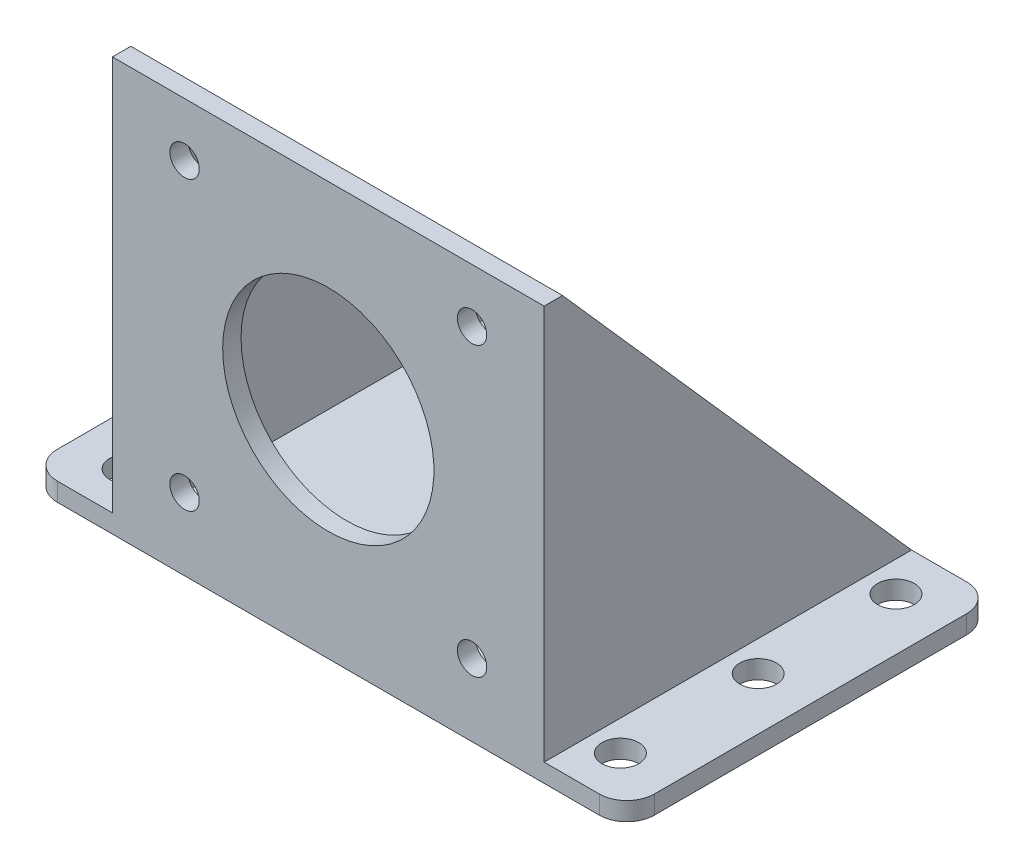
ISO-10303-21;
HEADER;
FILE_DESCRIPTION(('STEP AP214'),'2;1');
FILE_NAME('part.step','',(''),(''),'','','');
FILE_SCHEMA(('AUTOMOTIVE_DESIGN { 1 0 10303 214 1 1 1 1 }'));
ENDSEC;
DATA;
#1=APPLICATION_CONTEXT('core data for automotive mechanical design processes');
#2=APPLICATION_PROTOCOL_DEFINITION('international standard','automotive_design',2000,#1);
#3=PRODUCT_CONTEXT('',#1,'mechanical');
#4=PRODUCT('Part','Part','',(#3));
#5=PRODUCT_RELATED_PRODUCT_CATEGORY('part','',(#4));
#6=PRODUCT_DEFINITION_FORMATION('','',#4);
#7=PRODUCT_DEFINITION_CONTEXT('part definition',#1,'design');
#8=PRODUCT_DEFINITION('design','',#6,#7);
#9=PRODUCT_DEFINITION_SHAPE('','',#8);
#10=(LENGTH_UNIT() NAMED_UNIT(*) SI_UNIT(.MILLI.,.METRE.));
#11=(NAMED_UNIT(*) PLANE_ANGLE_UNIT() SI_UNIT($,.RADIAN.));
#12=(NAMED_UNIT(*) SI_UNIT($,.STERADIAN.) SOLID_ANGLE_UNIT());
#13=UNCERTAINTY_MEASURE_WITH_UNIT(LENGTH_MEASURE(1.E-05),#10,'distance_accuracy_value','');
#14=(GEOMETRIC_REPRESENTATION_CONTEXT(3) GLOBAL_UNCERTAINTY_ASSIGNED_CONTEXT((#13)) GLOBAL_UNIT_ASSIGNED_CONTEXT((#10,
#11,#12)) REPRESENTATION_CONTEXT('',''));
#15=CARTESIAN_POINT('',(0.,0.,0.));
#16=DIRECTION('',(0.,0.,1.));
#17=DIRECTION('',(1.,0.,0.));
#18=AXIS2_PLACEMENT_3D('',#15,#16,#17);
#19=CARTESIAN_POINT('',(0.,2.,0.));
#20=DIRECTION('',(0.,-1.,0.));
#21=DIRECTION('',(0.,0.,-1.));
#22=AXIS2_PLACEMENT_3D('',#19,#20,#21);
#23=PLANE('',#22);
#24=DIRECTION('',(0.,0.,1.));
#25=VECTOR('',#24,1.);
#26=CARTESIAN_POINT('',(54.,2.,0.));
#27=LINE('',#26,#25);
#28=CARTESIAN_POINT('',(54.,2.00000000000001,-40.));
#29=VERTEX_POINT('',#28);
#30=CARTESIAN_POINT('',(54.,2.,-2.));
#31=VERTEX_POINT('',#30);
#32=EDGE_CURVE('E193',#29,#31,#27,.T.);
#33=ORIENTED_EDGE('',*,*,#32,.F.);
#34=DIRECTION('',(-1.,0.,0.));
#35=VECTOR('',#34,1.);
#36=CARTESIAN_POINT('',(0.,2.,-40.));
#37=LINE('',#36,#35);
#38=CARTESIAN_POINT('',(11.,2.,-40.));
#39=VERTEX_POINT('',#38);
#40=EDGE_CURVE('E162',#29,#39,#37,.T.);
#41=ORIENTED_EDGE('',*,*,#40,.T.);
#42=DIRECTION('',(0.,0.,-1.));
#43=VECTOR('',#42,1.);
#44=CARTESIAN_POINT('',(11.,2.,0.));
#45=LINE('',#44,#43);
#46=CARTESIAN_POINT('',(11.,2.,-2.));
#47=VERTEX_POINT('',#46);
#48=EDGE_CURVE('E204',#47,#39,#45,.T.);
#49=ORIENTED_EDGE('',*,*,#48,.F.);
#50=DIRECTION('',(1.,0.,0.));
#51=VECTOR('',#50,1.);
#52=CARTESIAN_POINT('',(9.,2.,-2.));
#53=LINE('',#52,#51);
#54=EDGE_CURVE('E214',#47,#31,#53,.T.);
#55=ORIENTED_EDGE('',*,*,#54,.T.);
#56=EDGE_LOOP('',(#33,#41,#49,#55));
#57=FACE_BOUND('',#56,.T.);
#58=ADVANCED_FACE('F39',(#57),#23,.F.);
#59=CARTESIAN_POINT('',(0.,0.,-2.));
#60=DIRECTION('',(0.,0.,-1.));
#61=DIRECTION('',(-1.,0.,0.));
#62=AXIS2_PLACEMENT_3D('',#59,#60,#61);
#63=PLANE('',#62);
#64=CARTESIAN_POINT('',(48.1500000000001,39.15,-2.));
#65=DIRECTION('',(0.,0.,-1.));
#66=DIRECTION('',(-1.,0.,0.));
#67=AXIS2_PLACEMENT_3D('',#64,#65,#66);
#68=CIRCLE('',#67,1.6);
#69=CARTESIAN_POINT('',(46.5500000000001,39.15,-2.));
#70=VERTEX_POINT('',#69);
#71=EDGE_CURVE('E431',#70,#70,#68,.T.);
#72=ORIENTED_EDGE('',*,*,#71,.F.);
#73=EDGE_LOOP('',(#72));
#74=FACE_BOUND('',#73,.T.);
#75=CARTESIAN_POINT('',(16.8500000000001,39.15,-2.));
#76=DIRECTION('',(0.,0.,-1.));
#77=DIRECTION('',(-1.,0.,0.));
#78=AXIS2_PLACEMENT_3D('',#75,#76,#77);
#79=CIRCLE('',#78,1.6);
#80=CARTESIAN_POINT('',(15.2500000000001,39.15,-2.));
#81=VERTEX_POINT('',#80);
#82=EDGE_CURVE('E439',#81,#81,#79,.T.);
#83=ORIENTED_EDGE('',*,*,#82,.F.);
#84=EDGE_LOOP('',(#83));
#85=FACE_BOUND('',#84,.T.);
#86=CARTESIAN_POINT('',(16.85,7.85,-2.));
#87=DIRECTION('',(0.,0.,-1.));
#88=DIRECTION('',(-1.,0.,0.));
#89=AXIS2_PLACEMENT_3D('',#86,#87,#88);
#90=CIRCLE('',#89,1.6);
#91=CARTESIAN_POINT('',(15.25,7.85,-2.));
#92=VERTEX_POINT('',#91);
#93=EDGE_CURVE('E447',#92,#92,#90,.T.);
#94=ORIENTED_EDGE('',*,*,#93,.F.);
#95=EDGE_LOOP('',(#94));
#96=FACE_BOUND('',#95,.T.);
#97=CARTESIAN_POINT('',(48.15,7.85,-2.));
#98=DIRECTION('',(0.,0.,-1.));
#99=DIRECTION('',(-1.,0.,0.));
#100=AXIS2_PLACEMENT_3D('',#97,#98,#99);
#101=CIRCLE('',#100,1.6);
#102=CARTESIAN_POINT('',(46.55,7.85,-2.));
#103=VERTEX_POINT('',#102);
#104=EDGE_CURVE('E455',#103,#103,#101,.T.);
#105=ORIENTED_EDGE('',*,*,#104,.F.);
#106=EDGE_LOOP('',(#105));
#107=FACE_BOUND('',#106,.T.);
#108=CARTESIAN_POINT('',(32.5,23.5,-2.));
#109=DIRECTION('',(0.,0.,-1.));
#110=DIRECTION('',(-1.,0.,0.));
#111=AXIS2_PLACEMENT_3D('',#108,#109,#110);
#112=CIRCLE('',#111,11.5);
#113=CARTESIAN_POINT('',(21.,23.5,-2.));
#114=VERTEX_POINT('',#113);
#115=EDGE_CURVE('E423',#114,#114,#112,.T.);
#116=ORIENTED_EDGE('',*,*,#115,.F.);
#117=EDGE_LOOP('',(#116));
#118=FACE_BOUND('',#117,.T.);
#119=DIRECTION('',(-1.,0.,0.));
#120=VECTOR('',#119,1.);
#121=CARTESIAN_POINT('',(9.,45.,-2.));
#122=LINE('',#121,#120);
#123=CARTESIAN_POINT('',(54.,45.,-2.));
#124=VERTEX_POINT('',#123);
#125=CARTESIAN_POINT('',(11.,45.,-2.));
#126=VERTEX_POINT('',#125);
#127=EDGE_CURVE('E222',#124,#126,#122,.T.);
#128=ORIENTED_EDGE('',*,*,#127,.F.);
#129=DIRECTION('',(0.,-1.,0.));
#130=VECTOR('',#129,1.);
#131=CARTESIAN_POINT('',(54.,0.,-2.));
#132=LINE('',#131,#130);
#133=EDGE_CURVE('E185',#124,#31,#132,.T.);
#134=ORIENTED_EDGE('',*,*,#133,.T.);
#135=ORIENTED_EDGE('',*,*,#54,.F.);
#136=DIRECTION('',(0.,1.,0.));
#137=VECTOR('',#136,1.);
#138=CARTESIAN_POINT('',(11.,0.,-2.));
#139=LINE('',#138,#137);
#140=EDGE_CURVE('E161',#47,#126,#139,.T.);
#141=ORIENTED_EDGE('',*,*,#140,.T.);
#142=EDGE_LOOP('',(#128,#134,#135,#141));
#143=FACE_BOUND('',#142,.T.);
#144=ADVANCED_FACE('F415',(#74,#85,#96,#107,#118,#143),#63,.T.);
#145=CARTESIAN_POINT('',(59.3,2.,-5.));
#146=DIRECTION('',(0.,1.,0.));
#147=DIRECTION('',(0.,0.,-1.));
#148=AXIS2_PLACEMENT_3D('',#145,#146,#147);
#149=CIRCLE('',#148,2.);
#150=CARTESIAN_POINT('',(59.3,2.,-7.));
#151=VERTEX_POINT('',#150);
#152=EDGE_CURVE('E269',#151,#151,#149,.T.);
#153=ORIENTED_EDGE('',*,*,#152,.F.);
#154=EDGE_LOOP('',(#153));
#155=FACE_BOUND('',#154,.T.);
#156=CARTESIAN_POINT('',(59.3,2.,-20.));
#157=DIRECTION('',(0.,1.,0.));
#158=DIRECTION('',(0.,0.,-1.));
#159=AXIS2_PLACEMENT_3D('',#156,#157,#158);
#160=CIRCLE('',#159,2.);
#161=CARTESIAN_POINT('',(59.3,2.,-22.));
#162=VERTEX_POINT('',#161);
#163=EDGE_CURVE('E244',#162,#162,#160,.T.);
#164=ORIENTED_EDGE('',*,*,#163,.F.);
#165=EDGE_LOOP('',(#164));
#166=FACE_BOUND('',#165,.T.);
#167=CARTESIAN_POINT('',(59.3,2.,-35.));
#168=DIRECTION('',(0.,1.,0.));
#169=DIRECTION('',(0.,0.,-1.));
#170=AXIS2_PLACEMENT_3D('',#167,#168,#169);
#171=CIRCLE('',#170,2.);
#172=CARTESIAN_POINT('',(59.3,2.,-37.));
#173=VERTEX_POINT('',#172);
#174=EDGE_CURVE('E234',#173,#173,#171,.T.);
#175=ORIENTED_EDGE('',*,*,#174,.F.);
#176=EDGE_LOOP('',(#175));
#177=FACE_BOUND('',#176,.T.);
#178=DIRECTION('',(0.,0.,-1.));
#179=VECTOR('',#178,1.);
#180=CARTESIAN_POINT('',(65.,2.,0.));
#181=LINE('',#180,#179);
#182=CARTESIAN_POINT('',(65.,2.,-3.));
#183=VERTEX_POINT('',#182);
#184=CARTESIAN_POINT('',(65.,2.,-37.));
#185=VERTEX_POINT('',#184);
#186=EDGE_CURVE('E296',#183,#185,#181,.T.);
#187=ORIENTED_EDGE('',*,*,#186,.T.);
#188=CARTESIAN_POINT('',(62.,2.,-37.));
#189=DIRECTION('',(0.,-1.,0.));
#190=DIRECTION('',(0.,0.,-1.));
#191=AXIS2_PLACEMENT_3D('',#188,#189,#190);
#192=CIRCLE('',#191,3.);
#193=CARTESIAN_POINT('',(62.,2.,-40.));
#194=VERTEX_POINT('',#193);
#195=EDGE_CURVE('E155',#185,#194,#192,.F.);
#196=ORIENTED_EDGE('',*,*,#195,.T.);
#197=CARTESIAN_POINT('',(56.,2.00000000000001,-40.));
#198=VERTEX_POINT('',#197);
#199=EDGE_CURVE('E147',#194,#198,#37,.T.);
#200=ORIENTED_EDGE('',*,*,#199,.T.);
#201=DIRECTION('',(0.,0.,1.));
#202=VECTOR('',#201,1.);
#203=CARTESIAN_POINT('',(56.,2.,-2.));
#204=LINE('',#203,#202);
#205=CARTESIAN_POINT('',(56.,2.,0.));
#206=VERTEX_POINT('',#205);
#207=EDGE_CURVE('E152',#198,#206,#204,.T.);
#208=ORIENTED_EDGE('',*,*,#207,.T.);
#209=DIRECTION('',(1.,0.,0.));
#210=VECTOR('',#209,1.);
#211=CARTESIAN_POINT('',(0.,2.,0.));
#212=LINE('',#211,#210);
#213=CARTESIAN_POINT('',(62.,2.,0.));
#214=VERTEX_POINT('',#213);
#215=EDGE_CURVE('E291',#206,#214,#212,.T.);
#216=ORIENTED_EDGE('',*,*,#215,.T.);
#217=CARTESIAN_POINT('',(62.,2.,-3.));
#218=DIRECTION('',(0.,-1.,0.));
#219=DIRECTION('',(0.,0.,-1.));
#220=AXIS2_PLACEMENT_3D('',#217,#218,#219);
#221=CIRCLE('',#220,3.);
#222=EDGE_CURVE('E340',#214,#183,#221,.F.);
#223=ORIENTED_EDGE('',*,*,#222,.T.);
#224=EDGE_LOOP('',(#187,#196,#200,#208,#216,#223));
#225=FACE_BOUND('',#224,.T.);
#226=ADVANCED_FACE('F150',(#155,#166,#177,#225),#23,.F.);
#227=CARTESIAN_POINT('',(5.7,2.,-5.));
#228=DIRECTION('',(0.,1.,0.));
#229=DIRECTION('',(0.,0.,1.));
#230=AXIS2_PLACEMENT_3D('',#227,#228,#229);
#231=CIRCLE('',#230,2.);
#232=CARTESIAN_POINT('',(5.7,2.,-3.));
#233=VERTEX_POINT('',#232);
#234=EDGE_CURVE('E252',#233,#233,#231,.T.);
#235=ORIENTED_EDGE('',*,*,#234,.F.);
#236=EDGE_LOOP('',(#235));
#237=FACE_BOUND('',#236,.T.);
#238=CARTESIAN_POINT('',(5.7,2.,-35.));
#239=DIRECTION('',(0.,1.,0.));
#240=DIRECTION('',(0.,0.,1.));
#241=AXIS2_PLACEMENT_3D('',#238,#239,#240);
#242=CIRCLE('',#241,2.);
#243=CARTESIAN_POINT('',(5.7,2.,-33.));
#244=VERTEX_POINT('',#243);
#245=EDGE_CURVE('E261',#244,#244,#242,.T.);
#246=ORIENTED_EDGE('',*,*,#245,.F.);
#247=EDGE_LOOP('',(#246));
#248=FACE_BOUND('',#247,.T.);
#249=CARTESIAN_POINT('',(5.7,2.,-20.));
#250=DIRECTION('',(0.,1.,0.));
#251=DIRECTION('',(0.,0.,1.));
#252=AXIS2_PLACEMENT_3D('',#249,#250,#251);
#253=CIRCLE('',#252,2.);
#254=CARTESIAN_POINT('',(5.7,2.,-18.));
#255=VERTEX_POINT('',#254);
#256=EDGE_CURVE('E253',#255,#255,#253,.T.);
#257=ORIENTED_EDGE('',*,*,#256,.F.);
#258=EDGE_LOOP('',(#257));
#259=FACE_BOUND('',#258,.T.);
#260=CARTESIAN_POINT('',(9.,2.,-40.));
#261=VERTEX_POINT('',#260);
#262=CARTESIAN_POINT('',(3.,2.,-40.));
#263=VERTEX_POINT('',#262);
#264=EDGE_CURVE('E164',#261,#263,#37,.T.);
#265=ORIENTED_EDGE('',*,*,#264,.T.);
#266=CARTESIAN_POINT('',(3.,2.,-37.));
#267=DIRECTION('',(0.,-1.,0.));
#268=DIRECTION('',(0.,0.,-1.));
#269=AXIS2_PLACEMENT_3D('',#266,#267,#268);
#270=CIRCLE('',#269,3.);
#271=CARTESIAN_POINT('',(0.,2.,-37.));
#272=VERTEX_POINT('',#271);
#273=EDGE_CURVE('E11',#263,#272,#270,.F.);
#274=ORIENTED_EDGE('',*,*,#273,.T.);
#275=DIRECTION('',(0.,0.,1.));
#276=VECTOR('',#275,1.);
#277=CARTESIAN_POINT('',(0.,2.,0.));
#278=LINE('',#277,#276);
#279=CARTESIAN_POINT('',(0.,2.,-3.));
#280=VERTEX_POINT('',#279);
#281=EDGE_CURVE('E288',#272,#280,#278,.T.);
#282=ORIENTED_EDGE('',*,*,#281,.T.);
#283=CARTESIAN_POINT('',(3.,2.,-3.));
#284=DIRECTION('',(0.,-1.,0.));
#285=DIRECTION('',(0.,0.,-1.));
#286=AXIS2_PLACEMENT_3D('',#283,#284,#285);
#287=CIRCLE('',#286,3.);
#288=CARTESIAN_POINT('',(3.,2.,0.));
#289=VERTEX_POINT('',#288);
#290=EDGE_CURVE('E48',#280,#289,#287,.F.);
#291=ORIENTED_EDGE('',*,*,#290,.T.);
#292=CARTESIAN_POINT('',(9.,2.,0.));
#293=VERTEX_POINT('',#292);
#294=EDGE_CURVE('E293',#289,#293,#212,.T.);
#295=ORIENTED_EDGE('',*,*,#294,.T.);
#296=DIRECTION('',(0.,0.,1.));
#297=VECTOR('',#296,1.);
#298=CARTESIAN_POINT('',(9.,2.,-2.));
#299=LINE('',#298,#297);
#300=EDGE_CURVE('E174',#261,#293,#299,.T.);
#301=ORIENTED_EDGE('',*,*,#300,.F.);
#302=EDGE_LOOP('',(#265,#274,#282,#291,#295,#301));
#303=FACE_BOUND('',#302,.T.);
#304=ADVANCED_FACE('F360',(#237,#248,#259,#303),#23,.F.);
#305=CARTESIAN_POINT('',(0.,2.,0.));
#306=DIRECTION('',(1.,0.,0.));
#307=DIRECTION('',(0.,0.,-1.));
#308=AXIS2_PLACEMENT_3D('',#305,#306,#307);
#309=PLANE('',#308);
#310=ORIENTED_EDGE('',*,*,#281,.F.);
#311=DIRECTION('',(0.,-1.,0.));
#312=VECTOR('',#311,1.);
#313=CARTESIAN_POINT('',(0.,2.,-37.));
#314=LINE('',#313,#312);
#315=CARTESIAN_POINT('',(0.,0.,-37.));
#316=VERTEX_POINT('',#315);
#317=EDGE_CURVE('E354',#272,#316,#314,.T.);
#318=ORIENTED_EDGE('',*,*,#317,.T.);
#319=DIRECTION('',(0.,0.,1.));
#320=VECTOR('',#319,1.);
#321=CARTESIAN_POINT('',(0.,0.,0.));
#322=LINE('',#321,#320);
#323=CARTESIAN_POINT('',(0.,0.,-3.));
#324=VERTEX_POINT('',#323);
#325=EDGE_CURVE('E284',#316,#324,#322,.T.);
#326=ORIENTED_EDGE('',*,*,#325,.T.);
#327=DIRECTION('',(0.,-1.,0.));
#328=VECTOR('',#327,1.);
#329=CARTESIAN_POINT('',(0.,2.,-3.));
#330=LINE('',#329,#328);
#331=EDGE_CURVE('E55',#324,#280,#330,.F.);
#332=ORIENTED_EDGE('',*,*,#331,.T.);
#333=EDGE_LOOP('',(#310,#318,#326,#332));
#334=FACE_BOUND('',#333,.T.);
#335=ADVANCED_FACE('F372',(#334),#309,.F.);
#336=CARTESIAN_POINT('',(0.,2.,0.));
#337=DIRECTION('',(0.,0.,-1.));
#338=DIRECTION('',(-1.,0.,0.));
#339=AXIS2_PLACEMENT_3D('',#336,#337,#338);
#340=PLANE('',#339);
#341=CARTESIAN_POINT('',(48.1500000000001,39.15,0.));
#342=DIRECTION('',(0.,0.,-1.));
#343=DIRECTION('',(-1.,0.,0.));
#344=AXIS2_PLACEMENT_3D('',#341,#342,#343);
#345=CIRCLE('',#344,1.6);
#346=CARTESIAN_POINT('',(46.5500000000001,39.15,0.));
#347=VERTEX_POINT('',#346);
#348=EDGE_CURVE('E435',#347,#347,#345,.T.);
#349=ORIENTED_EDGE('',*,*,#348,.T.);
#350=EDGE_LOOP('',(#349));
#351=FACE_BOUND('',#350,.T.);
#352=CARTESIAN_POINT('',(16.8500000000001,39.15,0.));
#353=DIRECTION('',(0.,0.,-1.));
#354=DIRECTION('',(-1.,0.,0.));
#355=AXIS2_PLACEMENT_3D('',#352,#353,#354);
#356=CIRCLE('',#355,1.6);
#357=CARTESIAN_POINT('',(15.2500000000001,39.15,0.));
#358=VERTEX_POINT('',#357);
#359=EDGE_CURVE('E443',#358,#358,#356,.T.);
#360=ORIENTED_EDGE('',*,*,#359,.T.);
#361=EDGE_LOOP('',(#360));
#362=FACE_BOUND('',#361,.T.);
#363=CARTESIAN_POINT('',(16.85,7.85,0.));
#364=DIRECTION('',(0.,0.,-1.));
#365=DIRECTION('',(-1.,0.,0.));
#366=AXIS2_PLACEMENT_3D('',#363,#364,#365);
#367=CIRCLE('',#366,1.6);
#368=CARTESIAN_POINT('',(15.25,7.85,0.));
#369=VERTEX_POINT('',#368);
#370=EDGE_CURVE('E451',#369,#369,#367,.T.);
#371=ORIENTED_EDGE('',*,*,#370,.T.);
#372=EDGE_LOOP('',(#371));
#373=FACE_BOUND('',#372,.T.);
#374=CARTESIAN_POINT('',(48.15,7.85,0.));
#375=DIRECTION('',(0.,0.,-1.));
#376=DIRECTION('',(-1.,0.,0.));
#377=AXIS2_PLACEMENT_3D('',#374,#375,#376);
#378=CIRCLE('',#377,1.6);
#379=CARTESIAN_POINT('',(46.55,7.85,0.));
#380=VERTEX_POINT('',#379);
#381=EDGE_CURVE('E427',#380,#380,#378,.T.);
#382=ORIENTED_EDGE('',*,*,#381,.T.);
#383=EDGE_LOOP('',(#382));
#384=FACE_BOUND('',#383,.T.);
#385=CARTESIAN_POINT('',(32.5,23.5,0.));
#386=DIRECTION('',(0.,0.,-1.));
#387=DIRECTION('',(-1.,0.,0.));
#388=AXIS2_PLACEMENT_3D('',#385,#386,#387);
#389=CIRCLE('',#388,11.5);
#390=CARTESIAN_POINT('',(21.,23.5,0.));
#391=VERTEX_POINT('',#390);
#392=EDGE_CURVE('E421',#391,#391,#389,.T.);
#393=ORIENTED_EDGE('',*,*,#392,.T.);
#394=EDGE_LOOP('',(#393));
#395=FACE_BOUND('',#394,.T.);
#396=DIRECTION('',(1.,0.,0.));
#397=VECTOR('',#396,1.);
#398=CARTESIAN_POINT('',(0.,0.,0.));
#399=LINE('',#398,#397);
#400=CARTESIAN_POINT('',(3.,0.,0.));
#401=VERTEX_POINT('',#400);
#402=CARTESIAN_POINT('',(62.,0.,0.));
#403=VERTEX_POINT('',#402);
#404=EDGE_CURVE('E301',#401,#403,#399,.T.);
#405=ORIENTED_EDGE('',*,*,#404,.T.);
#406=DIRECTION('',(0.,-1.,0.));
#407=VECTOR('',#406,1.);
#408=CARTESIAN_POINT('',(62.,2.,0.));
#409=LINE('',#408,#407);
#410=EDGE_CURVE('E349',#403,#214,#409,.F.);
#411=ORIENTED_EDGE('',*,*,#410,.T.);
#412=ORIENTED_EDGE('',*,*,#215,.F.);
#413=DIRECTION('',(0.,1.,0.));
#414=VECTOR('',#413,1.);
#415=CARTESIAN_POINT('',(56.,2.,0.));
#416=LINE('',#415,#414);
#417=CARTESIAN_POINT('',(56.,45.,0.));
#418=VERTEX_POINT('',#417);
#419=EDGE_CURVE('E171',#206,#418,#416,.T.);
#420=ORIENTED_EDGE('',*,*,#419,.T.);
#421=DIRECTION('',(-1.,0.,0.));
#422=VECTOR('',#421,1.);
#423=CARTESIAN_POINT('',(9.,45.,0.));
#424=LINE('',#423,#422);
#425=CARTESIAN_POINT('',(9.,45.,0.));
#426=VERTEX_POINT('',#425);
#427=EDGE_CURVE('E219',#418,#426,#424,.T.);
#428=ORIENTED_EDGE('',*,*,#427,.T.);
#429=DIRECTION('',(0.,-1.,0.));
#430=VECTOR('',#429,1.);
#431=CARTESIAN_POINT('',(9.,2.,0.));
#432=LINE('',#431,#430);
#433=EDGE_CURVE('E213',#426,#293,#432,.T.);
#434=ORIENTED_EDGE('',*,*,#433,.T.);
#435=ORIENTED_EDGE('',*,*,#294,.F.);
#436=DIRECTION('',(0.,-1.,0.));
#437=VECTOR('',#436,1.);
#438=CARTESIAN_POINT('',(3.,2.,0.));
#439=LINE('',#438,#437);
#440=EDGE_CURVE('E345',#289,#401,#439,.T.);
#441=ORIENTED_EDGE('',*,*,#440,.T.);
#442=EDGE_LOOP('',(#405,#411,#412,#420,#428,#434,#435,#441));
#443=FACE_BOUND('',#442,.T.);
#444=ADVANCED_FACE('F364',(#351,#362,#373,#384,#395,#443),#340,.F.);
#445=CARTESIAN_POINT('',(65.,2.,0.));
#446=DIRECTION('',(-1.,0.,0.));
#447=DIRECTION('',(0.,0.,1.));
#448=AXIS2_PLACEMENT_3D('',#445,#446,#447);
#449=PLANE('',#448);
#450=DIRECTION('',(0.,0.,-1.));
#451=VECTOR('',#450,1.);
#452=CARTESIAN_POINT('',(65.,0.,0.));
#453=LINE('',#452,#451);
#454=CARTESIAN_POINT('',(65.,0.,-3.));
#455=VERTEX_POINT('',#454);
#456=CARTESIAN_POINT('',(65.,0.,-37.));
#457=VERTEX_POINT('',#456);
#458=EDGE_CURVE('E305',#455,#457,#453,.T.);
#459=ORIENTED_EDGE('',*,*,#458,.T.);
#460=DIRECTION('',(0.,-1.,0.));
#461=VECTOR('',#460,1.);
#462=CARTESIAN_POINT('',(65.,2.,-37.));
#463=LINE('',#462,#461);
#464=EDGE_CURVE('E337',#457,#185,#463,.F.);
#465=ORIENTED_EDGE('',*,*,#464,.T.);
#466=ORIENTED_EDGE('',*,*,#186,.F.);
#467=DIRECTION('',(0.,-1.,0.));
#468=VECTOR('',#467,1.);
#469=CARTESIAN_POINT('',(65.,2.,-3.));
#470=LINE('',#469,#468);
#471=EDGE_CURVE('E333',#183,#455,#470,.T.);
#472=ORIENTED_EDGE('',*,*,#471,.T.);
#473=EDGE_LOOP('',(#459,#465,#466,#472));
#474=FACE_BOUND('',#473,.T.);
#475=ADVANCED_FACE('F383',(#474),#449,.F.);
#476=CARTESIAN_POINT('',(0.,2.,-40.));
#477=DIRECTION('',(0.,0.,1.));
#478=DIRECTION('',(1.,0.,0.));
#479=AXIS2_PLACEMENT_3D('',#476,#477,#478);
#480=PLANE('',#479);
#481=ORIENTED_EDGE('',*,*,#199,.F.);
#482=DIRECTION('',(0.,-1.,0.));
#483=VECTOR('',#482,1.);
#484=CARTESIAN_POINT('',(62.,2.,-40.));
#485=LINE('',#484,#483);
#486=CARTESIAN_POINT('',(62.,0.,-40.));
#487=VERTEX_POINT('',#486);
#488=EDGE_CURVE('E318',#194,#487,#485,.T.);
#489=ORIENTED_EDGE('',*,*,#488,.T.);
#490=DIRECTION('',(-1.,0.,0.));
#491=VECTOR('',#490,1.);
#492=CARTESIAN_POINT('',(0.,0.,-40.));
#493=LINE('',#492,#491);
#494=CARTESIAN_POINT('',(3.,0.,-40.));
#495=VERTEX_POINT('',#494);
#496=EDGE_CURVE('E292',#487,#495,#493,.T.);
#497=ORIENTED_EDGE('',*,*,#496,.T.);
#498=DIRECTION('',(0.,-1.,0.));
#499=VECTOR('',#498,1.);
#500=CARTESIAN_POINT('',(3.,2.,-40.));
#501=LINE('',#500,#499);
#502=EDGE_CURVE('E315',#495,#263,#501,.F.);
#503=ORIENTED_EDGE('',*,*,#502,.T.);
#504=ORIENTED_EDGE('',*,*,#264,.F.);
#505=DIRECTION('',(1.,0.,0.));
#506=VECTOR('',#505,1.);
#507=CARTESIAN_POINT('',(0.,2.,-40.));
#508=LINE('',#507,#506);
#509=EDGE_CURVE('E209',#39,#261,#508,.F.);
#510=ORIENTED_EDGE('',*,*,#509,.F.);
#511=ORIENTED_EDGE('',*,*,#40,.F.);
#512=DIRECTION('',(1.,0.,0.));
#513=VECTOR('',#512,1.);
#514=CARTESIAN_POINT('',(0.,2.,-40.));
#515=LINE('',#514,#513);
#516=EDGE_CURVE('E179',#198,#29,#515,.F.);
#517=ORIENTED_EDGE('',*,*,#516,.F.);
#518=EDGE_LOOP('',(#481,#489,#497,#503,#504,#510,#511,#517));
#519=FACE_BOUND('',#518,.T.);
#520=ADVANCED_FACE('F189',(#519),#480,.F.);
#521=CARTESIAN_POINT('',(0.,0.,0.));
#522=DIRECTION('',(0.,-1.,0.));
#523=DIRECTION('',(0.,0.,-1.));
#524=AXIS2_PLACEMENT_3D('',#521,#522,#523);
#525=PLANE('',#524);
#526=ORIENTED_EDGE('',*,*,#496,.F.);
#527=CARTESIAN_POINT('',(62.,0.,-37.));
#528=DIRECTION('',(0.,-1.,0.));
#529=DIRECTION('',(0.,0.,-1.));
#530=AXIS2_PLACEMENT_3D('',#527,#528,#529);
#531=CIRCLE('',#530,3.);
#532=EDGE_CURVE('E330',#487,#457,#531,.T.);
#533=ORIENTED_EDGE('',*,*,#532,.T.);
#534=ORIENTED_EDGE('',*,*,#458,.F.);
#535=CARTESIAN_POINT('',(62.,0.,-3.));
#536=DIRECTION('',(0.,-1.,0.));
#537=DIRECTION('',(0.,0.,-1.));
#538=AXIS2_PLACEMENT_3D('',#535,#536,#537);
#539=CIRCLE('',#538,3.);
#540=EDGE_CURVE('E327',#455,#403,#539,.T.);
#541=ORIENTED_EDGE('',*,*,#540,.T.);
#542=ORIENTED_EDGE('',*,*,#404,.F.);
#543=CARTESIAN_POINT('',(3.,0.,-3.));
#544=DIRECTION('',(0.,-1.,0.));
#545=DIRECTION('',(0.,0.,-1.));
#546=AXIS2_PLACEMENT_3D('',#543,#544,#545);
#547=CIRCLE('',#546,3.);
#548=EDGE_CURVE('E321',#401,#324,#547,.T.);
#549=ORIENTED_EDGE('',*,*,#548,.T.);
#550=ORIENTED_EDGE('',*,*,#325,.F.);
#551=CARTESIAN_POINT('',(3.,0.,-37.));
#552=DIRECTION('',(0.,-1.,0.));
#553=DIRECTION('',(0.,0.,-1.));
#554=AXIS2_PLACEMENT_3D('',#551,#552,#553);
#555=CIRCLE('',#554,3.);
#556=EDGE_CURVE('E324',#316,#495,#555,.T.);
#557=ORIENTED_EDGE('',*,*,#556,.T.);
#558=EDGE_LOOP('',(#526,#533,#534,#541,#542,#549,#550,#557));
#559=FACE_BOUND('',#558,.T.);
#560=CARTESIAN_POINT('',(59.3,0.,-35.));
#561=DIRECTION('',(0.,1.,0.));
#562=DIRECTION('',(0.,0.,-1.));
#563=AXIS2_PLACEMENT_3D('',#560,#561,#562);
#564=CIRCLE('',#563,2.);
#565=CARTESIAN_POINT('',(59.3,0.,-37.));
#566=VERTEX_POINT('',#565);
#567=EDGE_CURVE('E240',#566,#566,#564,.T.);
#568=ORIENTED_EDGE('',*,*,#567,.T.);
#569=EDGE_LOOP('',(#568));
#570=FACE_BOUND('',#569,.T.);
#571=CARTESIAN_POINT('',(59.3,0.,-20.));
#572=DIRECTION('',(0.,1.,0.));
#573=DIRECTION('',(0.,0.,-1.));
#574=AXIS2_PLACEMENT_3D('',#571,#572,#573);
#575=CIRCLE('',#574,2.);
#576=CARTESIAN_POINT('',(59.3,0.,-22.));
#577=VERTEX_POINT('',#576);
#578=EDGE_CURVE('E273',#577,#577,#575,.T.);
#579=ORIENTED_EDGE('',*,*,#578,.T.);
#580=EDGE_LOOP('',(#579));
#581=FACE_BOUND('',#580,.T.);
#582=CARTESIAN_POINT('',(59.3,0.,-5.));
#583=DIRECTION('',(0.,1.,0.));
#584=DIRECTION('',(0.,0.,-1.));
#585=AXIS2_PLACEMENT_3D('',#582,#583,#584);
#586=CIRCLE('',#585,2.);
#587=CARTESIAN_POINT('',(59.3,0.,-7.));
#588=VERTEX_POINT('',#587);
#589=EDGE_CURVE('E265',#588,#588,#586,.T.);
#590=ORIENTED_EDGE('',*,*,#589,.T.);
#591=EDGE_LOOP('',(#590));
#592=FACE_BOUND('',#591,.T.);
#593=CARTESIAN_POINT('',(5.7,0.,-5.));
#594=DIRECTION('',(0.,1.,0.));
#595=DIRECTION('',(0.,0.,1.));
#596=AXIS2_PLACEMENT_3D('',#593,#594,#595);
#597=CIRCLE('',#596,2.);
#598=CARTESIAN_POINT('',(5.7,0.,-3.));
#599=VERTEX_POINT('',#598);
#600=EDGE_CURVE('E280',#599,#599,#597,.T.);
#601=ORIENTED_EDGE('',*,*,#600,.T.);
#602=EDGE_LOOP('',(#601));
#603=FACE_BOUND('',#602,.T.);
#604=CARTESIAN_POINT('',(5.7,0.,-35.));
#605=DIRECTION('',(0.,1.,0.));
#606=DIRECTION('',(0.,0.,1.));
#607=AXIS2_PLACEMENT_3D('',#604,#605,#606);
#608=CIRCLE('',#607,2.);
#609=CARTESIAN_POINT('',(5.7,0.,-33.));
#610=VERTEX_POINT('',#609);
#611=EDGE_CURVE('E257',#610,#610,#608,.T.);
#612=ORIENTED_EDGE('',*,*,#611,.T.);
#613=EDGE_LOOP('',(#612));
#614=FACE_BOUND('',#613,.T.);
#615=CARTESIAN_POINT('',(5.7,0.,-20.));
#616=DIRECTION('',(0.,1.,0.));
#617=DIRECTION('',(0.,0.,1.));
#618=AXIS2_PLACEMENT_3D('',#615,#616,#617);
#619=CIRCLE('',#618,2.);
#620=CARTESIAN_POINT('',(5.7,0.,-18.));
#621=VERTEX_POINT('',#620);
#622=EDGE_CURVE('E248',#621,#621,#619,.T.);
#623=ORIENTED_EDGE('',*,*,#622,.T.);
#624=EDGE_LOOP('',(#623));
#625=FACE_BOUND('',#624,.T.);
#626=ADVANCED_FACE('F370',(#559,#570,#581,#592,#603,#614,#625),#525,.T.);
#627=CARTESIAN_POINT('',(5.7,0.,-5.));
#628=DIRECTION('',(0.,1.,0.));
#629=DIRECTION('',(0.,0.,1.));
#630=AXIS2_PLACEMENT_3D('',#627,#628,#629);
#631=CYLINDRICAL_SURFACE('',#630,2.);
#632=ORIENTED_EDGE('',*,*,#600,.F.);
#633=EDGE_LOOP('',(#632));
#634=FACE_BOUND('',#633,.T.);
#635=ORIENTED_EDGE('',*,*,#234,.T.);
#636=EDGE_LOOP('',(#635));
#637=FACE_BOUND('',#636,.T.);
#638=ADVANCED_FACE('F532',(#634,#637),#631,.F.);
#639=CARTESIAN_POINT('',(59.3,0.,-35.));
#640=DIRECTION('',(0.,1.,0.));
#641=DIRECTION('',(0.,0.,1.));
#642=AXIS2_PLACEMENT_3D('',#639,#640,#641);
#643=CYLINDRICAL_SURFACE('',#642,2.);
#644=ORIENTED_EDGE('',*,*,#567,.F.);
#645=EDGE_LOOP('',(#644));
#646=FACE_BOUND('',#645,.T.);
#647=ORIENTED_EDGE('',*,*,#174,.T.);
#648=EDGE_LOOP('',(#647));
#649=FACE_BOUND('',#648,.T.);
#650=ADVANCED_FACE('F524',(#646,#649),#643,.F.);
#651=CARTESIAN_POINT('',(59.3,0.,-20.));
#652=DIRECTION('',(0.,1.,0.));
#653=DIRECTION('',(0.,0.,1.));
#654=AXIS2_PLACEMENT_3D('',#651,#652,#653);
#655=CYLINDRICAL_SURFACE('',#654,2.);
#656=ORIENTED_EDGE('',*,*,#578,.F.);
#657=EDGE_LOOP('',(#656));
#658=FACE_BOUND('',#657,.T.);
#659=ORIENTED_EDGE('',*,*,#163,.T.);
#660=EDGE_LOOP('',(#659));
#661=FACE_BOUND('',#660,.T.);
#662=ADVANCED_FACE('F528',(#658,#661),#655,.F.);
#663=CARTESIAN_POINT('',(59.3,0.,-5.));
#664=DIRECTION('',(0.,1.,0.));
#665=DIRECTION('',(0.,0.,1.));
#666=AXIS2_PLACEMENT_3D('',#663,#664,#665);
#667=CYLINDRICAL_SURFACE('',#666,2.);
#668=ORIENTED_EDGE('',*,*,#589,.F.);
#669=EDGE_LOOP('',(#668));
#670=FACE_BOUND('',#669,.T.);
#671=ORIENTED_EDGE('',*,*,#152,.T.);
#672=EDGE_LOOP('',(#671));
#673=FACE_BOUND('',#672,.T.);
#674=ADVANCED_FACE('F519',(#670,#673),#667,.F.);
#675=CARTESIAN_POINT('',(5.7,0.,-35.));
#676=DIRECTION('',(0.,1.,0.));
#677=DIRECTION('',(0.,0.,1.));
#678=AXIS2_PLACEMENT_3D('',#675,#676,#677);
#679=CYLINDRICAL_SURFACE('',#678,2.);
#680=ORIENTED_EDGE('',*,*,#611,.F.);
#681=EDGE_LOOP('',(#680));
#682=FACE_BOUND('',#681,.T.);
#683=ORIENTED_EDGE('',*,*,#245,.T.);
#684=EDGE_LOOP('',(#683));
#685=FACE_BOUND('',#684,.T.);
#686=ADVANCED_FACE('F511',(#682,#685),#679,.F.);
#687=CARTESIAN_POINT('',(5.7,0.,-20.));
#688=DIRECTION('',(0.,1.,0.));
#689=DIRECTION('',(0.,0.,1.));
#690=AXIS2_PLACEMENT_3D('',#687,#688,#689);
#691=CYLINDRICAL_SURFACE('',#690,2.);
#692=ORIENTED_EDGE('',*,*,#622,.F.);
#693=EDGE_LOOP('',(#692));
#694=FACE_BOUND('',#693,.T.);
#695=ORIENTED_EDGE('',*,*,#256,.T.);
#696=EDGE_LOOP('',(#695));
#697=FACE_BOUND('',#696,.T.);
#698=ADVANCED_FACE('F509',(#694,#697),#691,.F.);
#699=CARTESIAN_POINT('',(9.,2.,-2.));
#700=DIRECTION('',(-1.,0.,0.));
#701=DIRECTION('',(0.,0.,1.));
#702=AXIS2_PLACEMENT_3D('',#699,#700,#701);
#703=PLANE('',#702);
#704=ORIENTED_EDGE('',*,*,#433,.F.);
#705=DIRECTION('',(0.,0.,1.));
#706=VECTOR('',#705,1.);
#707=CARTESIAN_POINT('',(9.,45.,-2.));
#708=LINE('',#707,#706);
#709=CARTESIAN_POINT('',(9.,45.,-2.));
#710=VERTEX_POINT('',#709);
#711=EDGE_CURVE('E230',#710,#426,#708,.T.);
#712=ORIENTED_EDGE('',*,*,#711,.F.);
#713=DIRECTION('',(0.,0.749329085481146,0.662197796471711));
#714=VECTOR('',#713,1.);
#715=CARTESIAN_POINT('',(9.,2.,-40.));
#716=LINE('',#715,#714);
#717=EDGE_CURVE('E198',#261,#710,#716,.T.);
#718=ORIENTED_EDGE('',*,*,#717,.F.);
#719=ORIENTED_EDGE('',*,*,#300,.T.);
#720=EDGE_LOOP('',(#704,#712,#718,#719));
#721=FACE_BOUND('',#720,.T.);
#722=ADVANCED_FACE('F404',(#721),#703,.T.);
#723=CARTESIAN_POINT('',(9.,45.,-2.));
#724=DIRECTION('',(0.,1.,0.));
#725=DIRECTION('',(0.,0.,1.));
#726=AXIS2_PLACEMENT_3D('',#723,#724,#725);
#727=PLANE('',#726);
#728=CARTESIAN_POINT('',(56.,45.,-2.));
#729=VERTEX_POINT('',#728);
#730=EDGE_CURVE('E182',#729,#124,#122,.T.);
#731=ORIENTED_EDGE('',*,*,#730,.T.);
#732=ORIENTED_EDGE('',*,*,#127,.T.);
#733=EDGE_CURVE('E218',#126,#710,#122,.T.);
#734=ORIENTED_EDGE('',*,*,#733,.T.);
#735=ORIENTED_EDGE('',*,*,#711,.T.);
#736=ORIENTED_EDGE('',*,*,#427,.F.);
#737=DIRECTION('',(0.,0.,1.));
#738=VECTOR('',#737,1.);
#739=CARTESIAN_POINT('',(56.,45.,-2.));
#740=LINE('',#739,#738);
#741=EDGE_CURVE('E173',#729,#418,#740,.T.);
#742=ORIENTED_EDGE('',*,*,#741,.F.);
#743=EDGE_LOOP('',(#731,#732,#734,#735,#736,#742));
#744=FACE_BOUND('',#743,.T.);
#745=ADVANCED_FACE('F397',(#744),#727,.T.);
#746=CARTESIAN_POINT('',(56.,2.,-2.));
#747=DIRECTION('',(1.,0.,0.));
#748=DIRECTION('',(0.,0.,-1.));
#749=AXIS2_PLACEMENT_3D('',#746,#747,#748);
#750=PLANE('',#749);
#751=ORIENTED_EDGE('',*,*,#419,.F.);
#752=ORIENTED_EDGE('',*,*,#207,.F.);
#753=DIRECTION('',(0.,-0.749329085481146,-0.662197796471711));
#754=VECTOR('',#753,1.);
#755=CARTESIAN_POINT('',(56.,45.,-2.));
#756=LINE('',#755,#754);
#757=EDGE_CURVE('E168',#729,#198,#756,.T.);
#758=ORIENTED_EDGE('',*,*,#757,.F.);
#759=ORIENTED_EDGE('',*,*,#741,.T.);
#760=EDGE_LOOP('',(#751,#752,#758,#759));
#761=FACE_BOUND('',#760,.T.);
#762=ADVANCED_FACE('F167',(#761),#750,.T.);
#763=CARTESIAN_POINT('',(11.,22.5,-20.));
#764=DIRECTION('',(-1.,0.,0.));
#765=DIRECTION('',(0.,0.,1.));
#766=AXIS2_PLACEMENT_3D('',#763,#764,#765);
#767=PLANE('',#766);
#768=ORIENTED_EDGE('',*,*,#140,.F.);
#769=ORIENTED_EDGE('',*,*,#48,.T.);
#770=DIRECTION('',(0.,0.749329085481146,0.662197796471711));
#771=VECTOR('',#770,1.);
#772=CARTESIAN_POINT('',(11.,2.,-40.));
#773=LINE('',#772,#771);
#774=EDGE_CURVE('E192',#39,#126,#773,.T.);
#775=ORIENTED_EDGE('',*,*,#774,.T.);
#776=EDGE_LOOP('',(#768,#769,#775));
#777=FACE_BOUND('',#776,.T.);
#778=ADVANCED_FACE('F413',(#777),#767,.F.);
#779=CARTESIAN_POINT('',(9.,2.,-40.));
#780=DIRECTION('',(0.,-0.662197796471711,0.749329085481146));
#781=DIRECTION('',(0.,0.749329085481146,0.662197796471711));
#782=AXIS2_PLACEMENT_3D('',#779,#780,#781);
#783=PLANE('',#782);
#784=ORIENTED_EDGE('',*,*,#774,.F.);
#785=ORIENTED_EDGE('',*,*,#509,.T.);
#786=ORIENTED_EDGE('',*,*,#717,.T.);
#787=ORIENTED_EDGE('',*,*,#733,.F.);
#788=EDGE_LOOP('',(#784,#785,#786,#787));
#789=FACE_BOUND('',#788,.T.);
#790=ADVANCED_FACE('F405',(#789),#783,.F.);
#791=CARTESIAN_POINT('',(56.,45.,-2.));
#792=DIRECTION('',(0.,-0.662197796471711,0.749329085481146));
#793=DIRECTION('',(0.,-0.749329085481146,-0.662197796471711));
#794=AXIS2_PLACEMENT_3D('',#791,#792,#793);
#795=PLANE('',#794);
#796=ORIENTED_EDGE('',*,*,#757,.T.);
#797=ORIENTED_EDGE('',*,*,#516,.T.);
#798=DIRECTION('',(0.,-0.749329085481146,-0.662197796471711));
#799=VECTOR('',#798,1.);
#800=CARTESIAN_POINT('',(54.,45.,-2.));
#801=LINE('',#800,#799);
#802=EDGE_CURVE('E186',#124,#29,#801,.T.);
#803=ORIENTED_EDGE('',*,*,#802,.F.);
#804=ORIENTED_EDGE('',*,*,#730,.F.);
#805=EDGE_LOOP('',(#796,#797,#803,#804));
#806=FACE_BOUND('',#805,.T.);
#807=ADVANCED_FACE('F177',(#806),#795,.F.);
#808=CARTESIAN_POINT('',(54.,22.5,-20.));
#809=DIRECTION('',(1.,0.,0.));
#810=DIRECTION('',(0.,0.,-1.));
#811=AXIS2_PLACEMENT_3D('',#808,#809,#810);
#812=PLANE('',#811);
#813=ORIENTED_EDGE('',*,*,#802,.T.);
#814=ORIENTED_EDGE('',*,*,#32,.T.);
#815=ORIENTED_EDGE('',*,*,#133,.F.);
#816=EDGE_LOOP('',(#813,#814,#815));
#817=FACE_BOUND('',#816,.T.);
#818=ADVANCED_FACE('F480',(#817),#812,.F.);
#819=CARTESIAN_POINT('',(32.5,23.5,0.));
#820=DIRECTION('',(0.,0.,-1.));
#821=DIRECTION('',(-1.,0.,0.));
#822=AXIS2_PLACEMENT_3D('',#819,#820,#821);
#823=CYLINDRICAL_SURFACE('',#822,11.5);
#824=ORIENTED_EDGE('',*,*,#392,.F.);
#825=EDGE_LOOP('',(#824));
#826=FACE_BOUND('',#825,.T.);
#827=ORIENTED_EDGE('',*,*,#115,.T.);
#828=EDGE_LOOP('',(#827));
#829=FACE_BOUND('',#828,.T.);
#830=ADVANCED_FACE('F469',(#826,#829),#823,.F.);
#831=CARTESIAN_POINT('',(48.15,7.85,0.));
#832=DIRECTION('',(0.,0.,-1.));
#833=DIRECTION('',(-1.,0.,0.));
#834=AXIS2_PLACEMENT_3D('',#831,#832,#833);
#835=CYLINDRICAL_SURFACE('',#834,1.6);
#836=ORIENTED_EDGE('',*,*,#381,.F.);
#837=EDGE_LOOP('',(#836));
#838=FACE_BOUND('',#837,.T.);
#839=ORIENTED_EDGE('',*,*,#104,.T.);
#840=EDGE_LOOP('',(#839));
#841=FACE_BOUND('',#840,.T.);
#842=ADVANCED_FACE('F465',(#838,#841),#835,.F.);
#843=CARTESIAN_POINT('',(16.85,7.85,0.));
#844=DIRECTION('',(0.,0.,-1.));
#845=DIRECTION('',(-1.,0.,0.));
#846=AXIS2_PLACEMENT_3D('',#843,#844,#845);
#847=CYLINDRICAL_SURFACE('',#846,1.6);
#848=ORIENTED_EDGE('',*,*,#370,.F.);
#849=EDGE_LOOP('',(#848));
#850=FACE_BOUND('',#849,.T.);
#851=ORIENTED_EDGE('',*,*,#93,.T.);
#852=EDGE_LOOP('',(#851));
#853=FACE_BOUND('',#852,.T.);
#854=ADVANCED_FACE('F468',(#850,#853),#847,.F.);
#855=CARTESIAN_POINT('',(16.8500000000001,39.15,0.));
#856=DIRECTION('',(0.,0.,-1.));
#857=DIRECTION('',(-1.,0.,0.));
#858=AXIS2_PLACEMENT_3D('',#855,#856,#857);
#859=CYLINDRICAL_SURFACE('',#858,1.6);
#860=ORIENTED_EDGE('',*,*,#359,.F.);
#861=EDGE_LOOP('',(#860));
#862=FACE_BOUND('',#861,.T.);
#863=ORIENTED_EDGE('',*,*,#82,.T.);
#864=EDGE_LOOP('',(#863));
#865=FACE_BOUND('',#864,.T.);
#866=ADVANCED_FACE('F636',(#862,#865),#859,.F.);
#867=CARTESIAN_POINT('',(48.1500000000001,39.15,0.));
#868=DIRECTION('',(0.,0.,-1.));
#869=DIRECTION('',(-1.,0.,0.));
#870=AXIS2_PLACEMENT_3D('',#867,#868,#869);
#871=CYLINDRICAL_SURFACE('',#870,1.6);
#872=ORIENTED_EDGE('',*,*,#348,.F.);
#873=EDGE_LOOP('',(#872));
#874=FACE_BOUND('',#873,.T.);
#875=ORIENTED_EDGE('',*,*,#71,.T.);
#876=EDGE_LOOP('',(#875));
#877=FACE_BOUND('',#876,.T.);
#878=ADVANCED_FACE('F559',(#874,#877),#871,.F.);
#879=CARTESIAN_POINT('',(62.,2.,-37.));
#880=DIRECTION('',(0.,-1.,0.));
#881=DIRECTION('',(0.,0.,-1.));
#882=AXIS2_PLACEMENT_3D('',#879,#880,#881);
#883=CYLINDRICAL_SURFACE('',#882,3.);
#884=ORIENTED_EDGE('',*,*,#195,.F.);
#885=ORIENTED_EDGE('',*,*,#464,.F.);
#886=ORIENTED_EDGE('',*,*,#532,.F.);
#887=ORIENTED_EDGE('',*,*,#488,.F.);
#888=EDGE_LOOP('',(#884,#885,#886,#887));
#889=FACE_BOUND('',#888,.T.);
#890=ADVANCED_FACE('F379',(#889),#883,.T.);
#891=CARTESIAN_POINT('',(62.,2.,-3.));
#892=DIRECTION('',(0.,-1.,0.));
#893=DIRECTION('',(0.,0.,-1.));
#894=AXIS2_PLACEMENT_3D('',#891,#892,#893);
#895=CYLINDRICAL_SURFACE('',#894,3.);
#896=ORIENTED_EDGE('',*,*,#222,.F.);
#897=ORIENTED_EDGE('',*,*,#410,.F.);
#898=ORIENTED_EDGE('',*,*,#540,.F.);
#899=ORIENTED_EDGE('',*,*,#471,.F.);
#900=EDGE_LOOP('',(#896,#897,#898,#899));
#901=FACE_BOUND('',#900,.T.);
#902=ADVANCED_FACE('F388',(#901),#895,.T.);
#903=CARTESIAN_POINT('',(3.,2.,-37.));
#904=DIRECTION('',(0.,-1.,0.));
#905=DIRECTION('',(0.,0.,-1.));
#906=AXIS2_PLACEMENT_3D('',#903,#904,#905);
#907=CYLINDRICAL_SURFACE('',#906,3.);
#908=ORIENTED_EDGE('',*,*,#273,.F.);
#909=ORIENTED_EDGE('',*,*,#502,.F.);
#910=ORIENTED_EDGE('',*,*,#556,.F.);
#911=ORIENTED_EDGE('',*,*,#317,.F.);
#912=EDGE_LOOP('',(#908,#909,#910,#911));
#913=FACE_BOUND('',#912,.T.);
#914=ADVANCED_FACE('F375',(#913),#907,.T.);
#915=CARTESIAN_POINT('',(3.,2.,-3.));
#916=DIRECTION('',(0.,-1.,0.));
#917=DIRECTION('',(0.,0.,-1.));
#918=AXIS2_PLACEMENT_3D('',#915,#916,#917);
#919=CYLINDRICAL_SURFACE('',#918,3.);
#920=ORIENTED_EDGE('',*,*,#290,.F.);
#921=ORIENTED_EDGE('',*,*,#331,.F.);
#922=ORIENTED_EDGE('',*,*,#548,.F.);
#923=ORIENTED_EDGE('',*,*,#440,.F.);
#924=EDGE_LOOP('',(#920,#921,#922,#923));
#925=FACE_BOUND('',#924,.T.);
#926=ADVANCED_FACE('F41',(#925),#919,.T.);
#927=CLOSED_SHELL('',(#58,#144,#226,#304,#335,#444,#475,#520,#626,#638,#650,#662,#674,#686,#698,
#722,#745,#762,#778,#790,#807,#818,#830,#842,#854,#866,#878,#890,#902,#914,#926));
#928=MANIFOLD_SOLID_BREP('B2',#927);
#929=ADVANCED_BREP_SHAPE_REPRESENTATION('',(#18,#928),#14);
#930=SHAPE_DEFINITION_REPRESENTATION(#9,#929);
ENDSEC;
END-ISO-10303-21;
